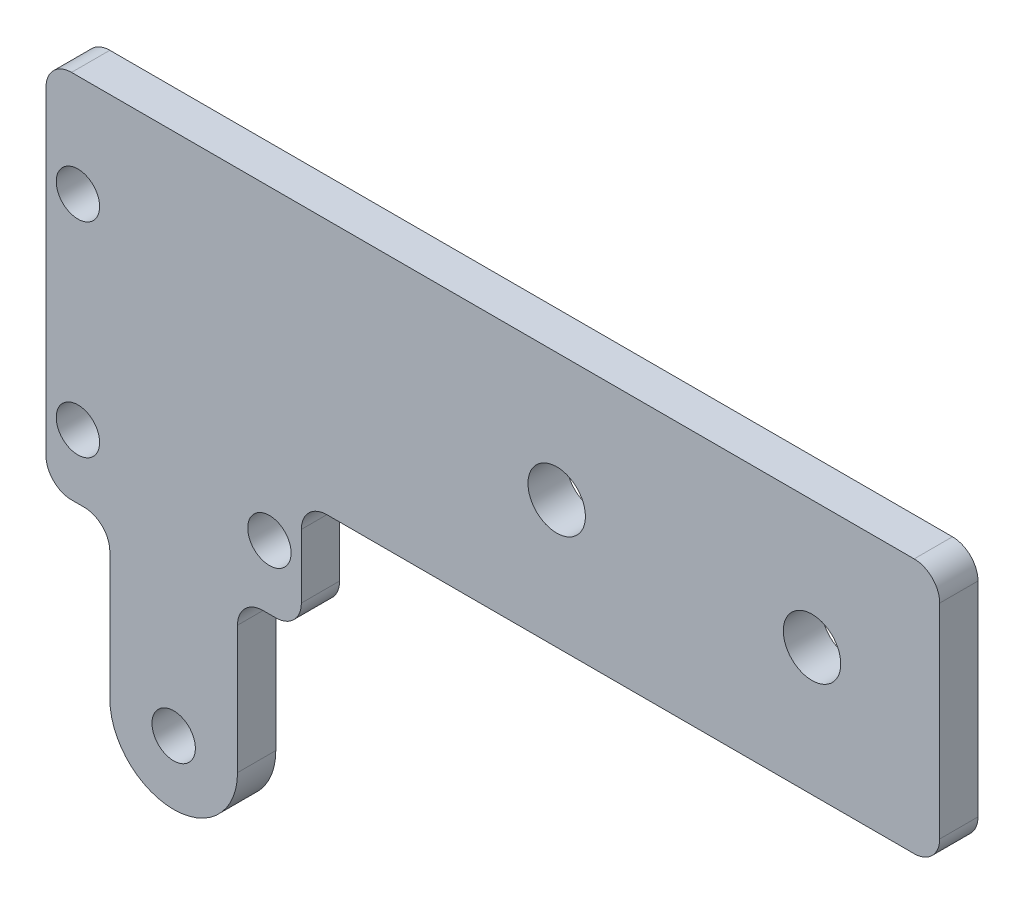
ISO-10303-21;
HEADER;
FILE_DESCRIPTION(('STEP AP214'),'2;1');
FILE_NAME('part.step','',(''),(''),'','','');
FILE_SCHEMA(('AUTOMOTIVE_DESIGN { 1 0 10303 214 1 1 1 1 }'));
ENDSEC;
DATA;
#1=APPLICATION_CONTEXT('core data for automotive mechanical design processes');
#2=APPLICATION_PROTOCOL_DEFINITION('international standard','automotive_design',2000,#1);
#3=PRODUCT_CONTEXT('',#1,'mechanical');
#4=PRODUCT('Part','Part','',(#3));
#5=PRODUCT_RELATED_PRODUCT_CATEGORY('part','',(#4));
#6=PRODUCT_DEFINITION_FORMATION('','',#4);
#7=PRODUCT_DEFINITION_CONTEXT('part definition',#1,'design');
#8=PRODUCT_DEFINITION('design','',#6,#7);
#9=PRODUCT_DEFINITION_SHAPE('','',#8);
#10=(LENGTH_UNIT() NAMED_UNIT(*) SI_UNIT(.MILLI.,.METRE.));
#11=(NAMED_UNIT(*) PLANE_ANGLE_UNIT() SI_UNIT($,.RADIAN.));
#12=(NAMED_UNIT(*) SI_UNIT($,.STERADIAN.) SOLID_ANGLE_UNIT());
#13=UNCERTAINTY_MEASURE_WITH_UNIT(LENGTH_MEASURE(1.E-05),#10,'distance_accuracy_value','');
#14=(GEOMETRIC_REPRESENTATION_CONTEXT(3) GLOBAL_UNCERTAINTY_ASSIGNED_CONTEXT((#13)) GLOBAL_UNIT_ASSIGNED_CONTEXT((#10,
#11,#12)) REPRESENTATION_CONTEXT('',''));
#15=CARTESIAN_POINT('',(0.,0.,0.));
#16=DIRECTION('',(0.,0.,1.));
#17=DIRECTION('',(1.,0.,0.));
#18=AXIS2_PLACEMENT_3D('',#15,#16,#17);
#19=CARTESIAN_POINT('',(50.,0.,3.));
#20=DIRECTION('',(0.,1.,0.));
#21=DIRECTION('',(-1.,0.,0.));
#22=AXIS2_PLACEMENT_3D('',#19,#20,#21);
#23=PLANE('',#22);
#24=DIRECTION('',(1.,0.,0.));
#25=VECTOR('',#24,1.);
#26=CARTESIAN_POINT('',(50.,0.,3.));
#27=LINE('',#26,#25);
#28=CARTESIAN_POINT('',(2.,0.,3.));
#29=VERTEX_POINT('',#28);
#30=CARTESIAN_POINT('',(48.,0.,3.));
#31=VERTEX_POINT('',#30);
#32=EDGE_CURVE('E223',#29,#31,#27,.T.);
#33=ORIENTED_EDGE('',*,*,#32,.F.);
#34=DIRECTION('',(0.,0.,-1.));
#35=VECTOR('',#34,1.);
#36=CARTESIAN_POINT('',(2.,0.,0.));
#37=LINE('',#36,#35);
#38=CARTESIAN_POINT('',(2.,0.,0.));
#39=VERTEX_POINT('',#38);
#40=EDGE_CURVE('E268',#29,#39,#37,.T.);
#41=ORIENTED_EDGE('',*,*,#40,.T.);
#42=DIRECTION('',(1.,0.,0.));
#43=VECTOR('',#42,1.);
#44=CARTESIAN_POINT('',(50.,0.,0.));
#45=LINE('',#44,#43);
#46=CARTESIAN_POINT('',(48.,0.,0.));
#47=VERTEX_POINT('',#46);
#48=EDGE_CURVE('E196',#39,#47,#45,.T.);
#49=ORIENTED_EDGE('',*,*,#48,.T.);
#50=DIRECTION('',(0.,0.,-1.));
#51=VECTOR('',#50,1.);
#52=CARTESIAN_POINT('',(48.,0.,3.));
#53=LINE('',#52,#51);
#54=EDGE_CURVE('E266',#47,#31,#53,.F.);
#55=ORIENTED_EDGE('',*,*,#54,.T.);
#56=EDGE_LOOP('',(#33,#41,#49,#55));
#57=FACE_BOUND('',#56,.T.);
#58=ADVANCED_FACE('F34',(#57),#23,.F.);
#59=CARTESIAN_POINT('',(50.,20.,3.));
#60=DIRECTION('',(-1.,0.,0.));
#61=DIRECTION('',(0.,0.,1.));
#62=AXIS2_PLACEMENT_3D('',#59,#60,#61);
#63=PLANE('',#62);
#64=DIRECTION('',(0.,1.,0.));
#65=VECTOR('',#64,1.);
#66=CARTESIAN_POINT('',(50.,20.,3.));
#67=LINE('',#66,#65);
#68=CARTESIAN_POINT('',(50.,2.,3.));
#69=VERTEX_POINT('',#68);
#70=CARTESIAN_POINT('',(50.,18.,3.));
#71=VERTEX_POINT('',#70);
#72=EDGE_CURVE('E303',#69,#71,#67,.T.);
#73=ORIENTED_EDGE('',*,*,#72,.F.);
#74=DIRECTION('',(0.,0.,-1.));
#75=VECTOR('',#74,1.);
#76=CARTESIAN_POINT('',(50.,2.,3.));
#77=LINE('',#76,#75);
#78=CARTESIAN_POINT('',(50.,2.,0.));
#79=VERTEX_POINT('',#78);
#80=EDGE_CURVE('E273',#69,#79,#77,.T.);
#81=ORIENTED_EDGE('',*,*,#80,.T.);
#82=DIRECTION('',(0.,1.,0.));
#83=VECTOR('',#82,1.);
#84=CARTESIAN_POINT('',(50.,20.,0.));
#85=LINE('',#84,#83);
#86=CARTESIAN_POINT('',(50.,18.,0.));
#87=VERTEX_POINT('',#86);
#88=EDGE_CURVE('E199',#79,#87,#85,.T.);
#89=ORIENTED_EDGE('',*,*,#88,.T.);
#90=DIRECTION('',(0.,0.,-1.));
#91=VECTOR('',#90,1.);
#92=CARTESIAN_POINT('',(50.,18.,3.));
#93=LINE('',#92,#91);
#94=EDGE_CURVE('E271',#87,#71,#93,.F.);
#95=ORIENTED_EDGE('',*,*,#94,.T.);
#96=EDGE_LOOP('',(#73,#81,#89,#95));
#97=FACE_BOUND('',#96,.T.);
#98=ADVANCED_FACE('F347',(#97),#63,.F.);
#99=CARTESIAN_POINT('',(-20.,20.,3.));
#100=DIRECTION('',(0.,-1.,0.));
#101=DIRECTION('',(0.,0.,-1.));
#102=AXIS2_PLACEMENT_3D('',#99,#100,#101);
#103=PLANE('',#102);
#104=DIRECTION('',(-1.,0.,0.));
#105=VECTOR('',#104,1.);
#106=CARTESIAN_POINT('',(-20.,20.,0.));
#107=LINE('',#106,#105);
#108=CARTESIAN_POINT('',(48.,20.,0.));
#109=VERTEX_POINT('',#108);
#110=CARTESIAN_POINT('',(-18.,20.,0.));
#111=VERTEX_POINT('',#110);
#112=EDGE_CURVE('E203',#109,#111,#107,.T.);
#113=ORIENTED_EDGE('',*,*,#112,.T.);
#114=DIRECTION('',(0.,0.,-1.));
#115=VECTOR('',#114,1.);
#116=CARTESIAN_POINT('',(-18.,20.,3.));
#117=LINE('',#116,#115);
#118=CARTESIAN_POINT('',(-18.,20.,3.));
#119=VERTEX_POINT('',#118);
#120=EDGE_CURVE('E279',#111,#119,#117,.F.);
#121=ORIENTED_EDGE('',*,*,#120,.T.);
#122=DIRECTION('',(-1.,0.,0.));
#123=VECTOR('',#122,1.);
#124=CARTESIAN_POINT('',(-20.,20.,3.));
#125=LINE('',#124,#123);
#126=CARTESIAN_POINT('',(48.,20.,3.));
#127=VERTEX_POINT('',#126);
#128=EDGE_CURVE('E306',#127,#119,#125,.T.);
#129=ORIENTED_EDGE('',*,*,#128,.F.);
#130=DIRECTION('',(0.,0.,-1.));
#131=VECTOR('',#130,1.);
#132=CARTESIAN_POINT('',(48.,20.,3.));
#133=LINE('',#132,#131);
#134=EDGE_CURVE('E276',#127,#109,#133,.T.);
#135=ORIENTED_EDGE('',*,*,#134,.T.);
#136=EDGE_LOOP('',(#113,#121,#129,#135));
#137=FACE_BOUND('',#136,.T.);
#138=ADVANCED_FACE('F352',(#137),#103,.F.);
#139=CARTESIAN_POINT('',(-20.,-9.,3.));
#140=DIRECTION('',(1.,0.,0.));
#141=DIRECTION('',(0.,0.,-1.));
#142=AXIS2_PLACEMENT_3D('',#139,#140,#141);
#143=PLANE('',#142);
#144=DIRECTION('',(0.,-1.,0.));
#145=VECTOR('',#144,1.);
#146=CARTESIAN_POINT('',(-20.,-9.,0.));
#147=LINE('',#146,#145);
#148=CARTESIAN_POINT('',(-20.,18.,0.));
#149=VERTEX_POINT('',#148);
#150=CARTESIAN_POINT('',(-20.,-7.,0.));
#151=VERTEX_POINT('',#150);
#152=EDGE_CURVE('E206',#149,#151,#147,.T.);
#153=ORIENTED_EDGE('',*,*,#152,.T.);
#154=DIRECTION('',(0.,0.,-1.));
#155=VECTOR('',#154,1.);
#156=CARTESIAN_POINT('',(-20.,-7.,3.));
#157=LINE('',#156,#155);
#158=CARTESIAN_POINT('',(-20.,-7.,3.));
#159=VERTEX_POINT('',#158);
#160=EDGE_CURVE('E242',#151,#159,#157,.F.);
#161=ORIENTED_EDGE('',*,*,#160,.T.);
#162=DIRECTION('',(0.,-1.,0.));
#163=VECTOR('',#162,1.);
#164=CARTESIAN_POINT('',(-20.,-9.,3.));
#165=LINE('',#164,#163);
#166=CARTESIAN_POINT('',(-20.,18.,3.));
#167=VERTEX_POINT('',#166);
#168=EDGE_CURVE('E314',#167,#159,#165,.T.);
#169=ORIENTED_EDGE('',*,*,#168,.F.);
#170=DIRECTION('',(0.,0.,-1.));
#171=VECTOR('',#170,1.);
#172=CARTESIAN_POINT('',(-20.,18.,3.));
#173=LINE('',#172,#171);
#174=EDGE_CURVE('E239',#167,#149,#173,.T.);
#175=ORIENTED_EDGE('',*,*,#174,.T.);
#176=EDGE_LOOP('',(#153,#161,#169,#175));
#177=FACE_BOUND('',#176,.T.);
#178=ADVANCED_FACE('F424',(#177),#143,.F.);
#179=CARTESIAN_POINT('',(-15.,-9.,3.));
#180=DIRECTION('',(0.,1.,0.));
#181=DIRECTION('',(-1.,0.,0.));
#182=AXIS2_PLACEMENT_3D('',#179,#180,#181);
#183=PLANE('',#182);
#184=DIRECTION('',(1.,0.,0.));
#185=VECTOR('',#184,1.);
#186=CARTESIAN_POINT('',(-15.,-9.,3.));
#187=LINE('',#186,#185);
#188=CARTESIAN_POINT('',(-18.,-9.,3.));
#189=VERTEX_POINT('',#188);
#190=CARTESIAN_POINT('',(-17.,-9.,3.));
#191=VERTEX_POINT('',#190);
#192=EDGE_CURVE('E172',#189,#191,#187,.T.);
#193=ORIENTED_EDGE('',*,*,#192,.F.);
#194=DIRECTION('',(0.,0.,-1.));
#195=VECTOR('',#194,1.);
#196=CARTESIAN_POINT('',(-18.,-9.,3.));
#197=LINE('',#196,#195);
#198=CARTESIAN_POINT('',(-18.,-9.,0.));
#199=VERTEX_POINT('',#198);
#200=EDGE_CURVE('E226',#189,#199,#197,.T.);
#201=ORIENTED_EDGE('',*,*,#200,.T.);
#202=DIRECTION('',(1.,0.,0.));
#203=VECTOR('',#202,1.);
#204=CARTESIAN_POINT('',(-15.,-9.,0.));
#205=LINE('',#204,#203);
#206=CARTESIAN_POINT('',(-17.,-9.,0.));
#207=VERTEX_POINT('',#206);
#208=EDGE_CURVE('E209',#199,#207,#205,.T.);
#209=ORIENTED_EDGE('',*,*,#208,.T.);
#210=DIRECTION('',(0.,0.,-1.));
#211=VECTOR('',#210,1.);
#212=CARTESIAN_POINT('',(-17.,-9.,3.));
#213=LINE('',#212,#211);
#214=EDGE_CURVE('E181',#207,#191,#213,.F.);
#215=ORIENTED_EDGE('',*,*,#214,.T.);
#216=EDGE_LOOP('',(#193,#201,#209,#215));
#217=FACE_BOUND('',#216,.T.);
#218=ADVANCED_FACE('F427',(#217),#183,.F.);
#219=CARTESIAN_POINT('',(-15.,-21.,3.));
#220=DIRECTION('',(1.,0.,0.));
#221=DIRECTION('',(0.,1.,0.));
#222=AXIS2_PLACEMENT_3D('',#219,#220,#221);
#223=PLANE('',#222);
#224=DIRECTION('',(0.,-1.,0.));
#225=VECTOR('',#224,1.);
#226=CARTESIAN_POINT('',(-15.,-21.,3.));
#227=LINE('',#226,#225);
#228=CARTESIAN_POINT('',(-15.,-11.,3.));
#229=VERTEX_POINT('',#228);
#230=CARTESIAN_POINT('',(-15.,-21.,3.));
#231=VERTEX_POINT('',#230);
#232=EDGE_CURVE('E158',#229,#231,#227,.T.);
#233=ORIENTED_EDGE('',*,*,#232,.F.);
#234=DIRECTION('',(0.,0.,-1.));
#235=VECTOR('',#234,1.);
#236=CARTESIAN_POINT('',(-15.,-11.,0.));
#237=LINE('',#236,#235);
#238=CARTESIAN_POINT('',(-15.,-11.,0.));
#239=VERTEX_POINT('',#238);
#240=EDGE_CURVE('E253',#229,#239,#237,.T.);
#241=ORIENTED_EDGE('',*,*,#240,.T.);
#242=DIRECTION('',(0.,-1.,0.));
#243=VECTOR('',#242,1.);
#244=CARTESIAN_POINT('',(-15.,-21.,0.));
#245=LINE('',#244,#243);
#246=CARTESIAN_POINT('',(-15.,-21.,0.));
#247=VERTEX_POINT('',#246);
#248=EDGE_CURVE('E178',#239,#247,#245,.T.);
#249=ORIENTED_EDGE('',*,*,#248,.T.);
#250=DIRECTION('',(0.,0.,-1.));
#251=VECTOR('',#250,1.);
#252=CARTESIAN_POINT('',(-15.,-21.,3.));
#253=LINE('',#252,#251);
#254=EDGE_CURVE('E175',#231,#247,#253,.T.);
#255=ORIENTED_EDGE('',*,*,#254,.F.);
#256=EDGE_LOOP('',(#233,#241,#249,#255));
#257=FACE_BOUND('',#256,.T.);
#258=ADVANCED_FACE('F176',(#257),#223,.F.);
#259=CARTESIAN_POINT('',(-10.,-21.,3.));
#260=DIRECTION('',(0.,0.,-1.));
#261=DIRECTION('',(-1.,0.,0.));
#262=AXIS2_PLACEMENT_3D('',#259,#260,#261);
#263=CYLINDRICAL_SURFACE('',#262,5.);
#264=CARTESIAN_POINT('',(-10.,-21.,0.));
#265=DIRECTION('',(0.,0.,1.));
#266=DIRECTION('',(1.,0.,0.));
#267=AXIS2_PLACEMENT_3D('',#264,#265,#266);
#268=CIRCLE('',#267,5.);
#269=CARTESIAN_POINT('',(-5.,-21.,0.));
#270=VERTEX_POINT('',#269);
#271=EDGE_CURVE('E213',#247,#270,#268,.T.);
#272=ORIENTED_EDGE('',*,*,#271,.T.);
#273=DIRECTION('',(0.,0.,-1.));
#274=VECTOR('',#273,1.);
#275=CARTESIAN_POINT('',(-5.,-21.,3.));
#276=LINE('',#275,#274);
#277=CARTESIAN_POINT('',(-5.,-21.,3.));
#278=VERTEX_POINT('',#277);
#279=EDGE_CURVE('E182',#278,#270,#276,.T.);
#280=ORIENTED_EDGE('',*,*,#279,.F.);
#281=CARTESIAN_POINT('',(-10.,-21.,3.));
#282=DIRECTION('',(0.,0.,1.));
#283=DIRECTION('',(1.,0.,0.));
#284=AXIS2_PLACEMENT_3D('',#281,#282,#283);
#285=CIRCLE('',#284,5.);
#286=EDGE_CURVE('E164',#231,#278,#285,.T.);
#287=ORIENTED_EDGE('',*,*,#286,.F.);
#288=ORIENTED_EDGE('',*,*,#254,.T.);
#289=EDGE_LOOP('',(#272,#280,#287,#288));
#290=FACE_BOUND('',#289,.T.);
#291=ADVANCED_FACE('F184',(#290),#263,.T.);
#292=CARTESIAN_POINT('',(-5.,-9.,3.));
#293=DIRECTION('',(-1.,0.,0.));
#294=DIRECTION('',(0.,0.,1.));
#295=AXIS2_PLACEMENT_3D('',#292,#293,#294);
#296=PLANE('',#295);
#297=DIRECTION('',(0.,1.,0.));
#298=VECTOR('',#297,1.);
#299=CARTESIAN_POINT('',(-5.,-9.,0.));
#300=LINE('',#299,#298);
#301=CARTESIAN_POINT('',(-5.,-11.,0.));
#302=VERTEX_POINT('',#301);
#303=EDGE_CURVE('E215',#270,#302,#300,.T.);
#304=ORIENTED_EDGE('',*,*,#303,.T.);
#305=DIRECTION('',(0.,0.,-1.));
#306=VECTOR('',#305,1.);
#307=CARTESIAN_POINT('',(-5.,-11.,3.));
#308=LINE('',#307,#306);
#309=CARTESIAN_POINT('',(-5.,-11.,3.));
#310=VERTEX_POINT('',#309);
#311=EDGE_CURVE('E260',#302,#310,#308,.F.);
#312=ORIENTED_EDGE('',*,*,#311,.T.);
#313=DIRECTION('',(0.,1.,0.));
#314=VECTOR('',#313,1.);
#315=CARTESIAN_POINT('',(-5.,-9.,3.));
#316=LINE('',#315,#314);
#317=EDGE_CURVE('E187',#278,#310,#316,.T.);
#318=ORIENTED_EDGE('',*,*,#317,.F.);
#319=ORIENTED_EDGE('',*,*,#279,.T.);
#320=EDGE_LOOP('',(#304,#312,#318,#319));
#321=FACE_BOUND('',#320,.T.);
#322=ADVANCED_FACE('F324',(#321),#296,.F.);
#323=CARTESIAN_POINT('',(0.,-9.,3.));
#324=DIRECTION('',(0.,1.,0.));
#325=DIRECTION('',(0.,0.,1.));
#326=AXIS2_PLACEMENT_3D('',#323,#324,#325);
#327=PLANE('',#326);
#328=DIRECTION('',(1.,0.,0.));
#329=VECTOR('',#328,1.);
#330=CARTESIAN_POINT('',(0.,-9.,3.));
#331=LINE('',#330,#329);
#332=CARTESIAN_POINT('',(-3.,-9.,3.));
#333=VERTEX_POINT('',#332);
#334=CARTESIAN_POINT('',(-2.,-9.,3.));
#335=VERTEX_POINT('',#334);
#336=EDGE_CURVE('E189',#333,#335,#331,.T.);
#337=ORIENTED_EDGE('',*,*,#336,.F.);
#338=DIRECTION('',(0.,0.,-1.));
#339=VECTOR('',#338,1.);
#340=CARTESIAN_POINT('',(-3.,-9.,0.));
#341=LINE('',#340,#339);
#342=CARTESIAN_POINT('',(-3.,-9.,0.));
#343=VERTEX_POINT('',#342);
#344=EDGE_CURVE('E257',#333,#343,#341,.T.);
#345=ORIENTED_EDGE('',*,*,#344,.T.);
#346=DIRECTION('',(1.,0.,0.));
#347=VECTOR('',#346,1.);
#348=CARTESIAN_POINT('',(0.,-9.,0.));
#349=LINE('',#348,#347);
#350=CARTESIAN_POINT('',(-2.,-9.,0.));
#351=VERTEX_POINT('',#350);
#352=EDGE_CURVE('E218',#343,#351,#349,.T.);
#353=ORIENTED_EDGE('',*,*,#352,.T.);
#354=DIRECTION('',(0.,0.,-1.));
#355=VECTOR('',#354,1.);
#356=CARTESIAN_POINT('',(-2.,-9.,3.));
#357=LINE('',#356,#355);
#358=EDGE_CURVE('E255',#351,#335,#357,.F.);
#359=ORIENTED_EDGE('',*,*,#358,.T.);
#360=EDGE_LOOP('',(#337,#345,#353,#359));
#361=FACE_BOUND('',#360,.T.);
#362=ADVANCED_FACE('F333',(#361),#327,.F.);
#363=CARTESIAN_POINT('',(0.,0.,3.));
#364=DIRECTION('',(-1.,0.,0.));
#365=DIRECTION('',(0.,-1.,0.));
#366=AXIS2_PLACEMENT_3D('',#363,#364,#365);
#367=PLANE('',#366);
#368=DIRECTION('',(0.,1.,0.));
#369=VECTOR('',#368,1.);
#370=CARTESIAN_POINT('',(0.,0.,3.));
#371=LINE('',#370,#369);
#372=CARTESIAN_POINT('',(0.,-7.,3.));
#373=VERTEX_POINT('',#372);
#374=CARTESIAN_POINT('',(0.,-2.,3.));
#375=VERTEX_POINT('',#374);
#376=EDGE_CURVE('E194',#373,#375,#371,.T.);
#377=ORIENTED_EDGE('',*,*,#376,.F.);
#378=DIRECTION('',(0.,0.,-1.));
#379=VECTOR('',#378,1.);
#380=CARTESIAN_POINT('',(0.,-7.,3.));
#381=LINE('',#380,#379);
#382=CARTESIAN_POINT('',(0.,-7.,0.));
#383=VERTEX_POINT('',#382);
#384=EDGE_CURVE('E263',#373,#383,#381,.T.);
#385=ORIENTED_EDGE('',*,*,#384,.T.);
#386=DIRECTION('',(0.,1.,0.));
#387=VECTOR('',#386,1.);
#388=CARTESIAN_POINT('',(0.,0.,0.));
#389=LINE('',#388,#387);
#390=CARTESIAN_POINT('',(0.,-2.,0.));
#391=VERTEX_POINT('',#390);
#392=EDGE_CURVE('E221',#383,#391,#389,.T.);
#393=ORIENTED_EDGE('',*,*,#392,.T.);
#394=DIRECTION('',(0.,0.,-1.));
#395=VECTOR('',#394,1.);
#396=CARTESIAN_POINT('',(0.,-2.,3.));
#397=LINE('',#396,#395);
#398=EDGE_CURVE('E49',#391,#375,#397,.F.);
#399=ORIENTED_EDGE('',*,*,#398,.T.);
#400=EDGE_LOOP('',(#377,#385,#393,#399));
#401=FACE_BOUND('',#400,.T.);
#402=ADVANCED_FACE('F294',(#401),#367,.F.);
#403=CARTESIAN_POINT('',(-10.,-21.,3.));
#404=DIRECTION('',(0.,0.,1.));
#405=DIRECTION('',(1.,0.,0.));
#406=AXIS2_PLACEMENT_3D('',#403,#404,#405);
#407=PLANE('',#406);
#408=CARTESIAN_POINT('',(-17.5,12.,3.));
#409=DIRECTION('',(0.,0.,1.));
#410=DIRECTION('',(1.,0.,0.));
#411=AXIS2_PLACEMENT_3D('',#408,#409,#410);
#412=CIRCLE('',#411,1.7);
#413=CARTESIAN_POINT('',(-15.8,12.,3.));
#414=VERTEX_POINT('',#413);
#415=EDGE_CURVE('E611',#414,#414,#412,.T.);
#416=ORIENTED_EDGE('',*,*,#415,.F.);
#417=EDGE_LOOP('',(#416));
#418=FACE_BOUND('',#417,.T.);
#419=CARTESIAN_POINT('',(-2.5,-4.,3.));
#420=DIRECTION('',(0.,0.,1.));
#421=DIRECTION('',(1.,0.,0.));
#422=AXIS2_PLACEMENT_3D('',#419,#420,#421);
#423=CIRCLE('',#422,1.7);
#424=CARTESIAN_POINT('',(-0.800000000000001,-4.,3.));
#425=VERTEX_POINT('',#424);
#426=EDGE_CURVE('E605',#425,#425,#423,.T.);
#427=ORIENTED_EDGE('',*,*,#426,.F.);
#428=EDGE_LOOP('',(#427));
#429=FACE_BOUND('',#428,.T.);
#430=CARTESIAN_POINT('',(-17.5,-4.,3.));
#431=DIRECTION('',(0.,0.,1.));
#432=DIRECTION('',(1.,0.,0.));
#433=AXIS2_PLACEMENT_3D('',#430,#431,#432);
#434=CIRCLE('',#433,1.7);
#435=CARTESIAN_POINT('',(-15.8,-4.,3.));
#436=VERTEX_POINT('',#435);
#437=EDGE_CURVE('E599',#436,#436,#434,.T.);
#438=ORIENTED_EDGE('',*,*,#437,.F.);
#439=EDGE_LOOP('',(#438));
#440=FACE_BOUND('',#439,.T.);
#441=CARTESIAN_POINT('',(40.,10.,3.));
#442=DIRECTION('',(0.,0.,1.));
#443=DIRECTION('',(1.,0.,0.));
#444=AXIS2_PLACEMENT_3D('',#441,#442,#443);
#445=CIRCLE('',#444,2.25);
#446=CARTESIAN_POINT('',(42.25,10.,3.));
#447=VERTEX_POINT('',#446);
#448=EDGE_CURVE('E593',#447,#447,#445,.T.);
#449=ORIENTED_EDGE('',*,*,#448,.F.);
#450=EDGE_LOOP('',(#449));
#451=FACE_BOUND('',#450,.T.);
#452=CARTESIAN_POINT('',(20.,10.,3.));
#453=DIRECTION('',(0.,0.,1.));
#454=DIRECTION('',(1.,0.,0.));
#455=AXIS2_PLACEMENT_3D('',#452,#453,#454);
#456=CIRCLE('',#455,2.25);
#457=CARTESIAN_POINT('',(22.25,10.,3.));
#458=VERTEX_POINT('',#457);
#459=EDGE_CURVE('E583',#458,#458,#456,.T.);
#460=ORIENTED_EDGE('',*,*,#459,.F.);
#461=EDGE_LOOP('',(#460));
#462=FACE_BOUND('',#461,.T.);
#463=CARTESIAN_POINT('',(-10.,-21.,3.));
#464=DIRECTION('',(0.,0.,1.));
#465=DIRECTION('',(1.,0.,0.));
#466=AXIS2_PLACEMENT_3D('',#463,#464,#465);
#467=CIRCLE('',#466,1.7);
#468=CARTESIAN_POINT('',(-8.3,-21.,3.));
#469=VERTEX_POINT('',#468);
#470=EDGE_CURVE('E309',#469,#469,#467,.T.);
#471=ORIENTED_EDGE('',*,*,#470,.F.);
#472=EDGE_LOOP('',(#471));
#473=FACE_BOUND('',#472,.T.);
#474=ORIENTED_EDGE('',*,*,#168,.T.);
#475=CARTESIAN_POINT('',(-18.,-7.,3.));
#476=DIRECTION('',(0.,0.,1.));
#477=DIRECTION('',(1.,0.,0.));
#478=AXIS2_PLACEMENT_3D('',#475,#476,#477);
#479=CIRCLE('',#478,2.);
#480=EDGE_CURVE('E251',#159,#189,#479,.T.);
#481=ORIENTED_EDGE('',*,*,#480,.T.);
#482=ORIENTED_EDGE('',*,*,#192,.T.);
#483=CARTESIAN_POINT('',(-17.,-11.,3.));
#484=DIRECTION('',(0.,0.,1.));
#485=DIRECTION('',(1.,0.,0.));
#486=AXIS2_PLACEMENT_3D('',#483,#484,#485);
#487=CIRCLE('',#486,2.);
#488=EDGE_CURVE('E168',#191,#229,#487,.F.);
#489=ORIENTED_EDGE('',*,*,#488,.T.);
#490=ORIENTED_EDGE('',*,*,#232,.T.);
#491=ORIENTED_EDGE('',*,*,#286,.T.);
#492=ORIENTED_EDGE('',*,*,#317,.T.);
#493=CARTESIAN_POINT('',(-3.,-11.,3.));
#494=DIRECTION('',(0.,0.,1.));
#495=DIRECTION('',(1.,0.,0.));
#496=AXIS2_PLACEMENT_3D('',#493,#494,#495);
#497=CIRCLE('',#496,2.);
#498=EDGE_CURVE('E286',#310,#333,#497,.F.);
#499=ORIENTED_EDGE('',*,*,#498,.T.);
#500=ORIENTED_EDGE('',*,*,#336,.T.);
#501=CARTESIAN_POINT('',(-2.,-7.,3.));
#502=DIRECTION('',(0.,0.,1.));
#503=DIRECTION('',(1.,0.,0.));
#504=AXIS2_PLACEMENT_3D('',#501,#502,#503);
#505=CIRCLE('',#504,2.);
#506=EDGE_CURVE('E56',#335,#373,#505,.T.);
#507=ORIENTED_EDGE('',*,*,#506,.T.);
#508=ORIENTED_EDGE('',*,*,#376,.T.);
#509=CARTESIAN_POINT('',(2.,-2.,3.));
#510=DIRECTION('',(0.,0.,1.));
#511=DIRECTION('',(1.,0.,0.));
#512=AXIS2_PLACEMENT_3D('',#509,#510,#511);
#513=CIRCLE('',#512,2.);
#514=EDGE_CURVE('E11',#375,#29,#513,.F.);
#515=ORIENTED_EDGE('',*,*,#514,.T.);
#516=ORIENTED_EDGE('',*,*,#32,.T.);
#517=CARTESIAN_POINT('',(48.,2.,3.));
#518=DIRECTION('',(0.,0.,1.));
#519=DIRECTION('',(1.,0.,0.));
#520=AXIS2_PLACEMENT_3D('',#517,#518,#519);
#521=CIRCLE('',#520,2.);
#522=EDGE_CURVE('E248',#31,#69,#521,.T.);
#523=ORIENTED_EDGE('',*,*,#522,.T.);
#524=ORIENTED_EDGE('',*,*,#72,.T.);
#525=CARTESIAN_POINT('',(48.,18.,3.));
#526=DIRECTION('',(0.,0.,1.));
#527=DIRECTION('',(1.,0.,0.));
#528=AXIS2_PLACEMENT_3D('',#525,#526,#527);
#529=CIRCLE('',#528,2.);
#530=EDGE_CURVE('E244',#71,#127,#529,.T.);
#531=ORIENTED_EDGE('',*,*,#530,.T.);
#532=ORIENTED_EDGE('',*,*,#128,.T.);
#533=CARTESIAN_POINT('',(-18.,18.,3.));
#534=DIRECTION('',(0.,0.,1.));
#535=DIRECTION('',(1.,0.,0.));
#536=AXIS2_PLACEMENT_3D('',#533,#534,#535);
#537=CIRCLE('',#536,2.);
#538=EDGE_CURVE('E246',#119,#167,#537,.T.);
#539=ORIENTED_EDGE('',*,*,#538,.T.);
#540=EDGE_LOOP('',(#474,#481,#482,#489,#490,#491,#492,#499,#500,#507,#508,#515,#516,#523,#524,
#531,#532,#539));
#541=FACE_BOUND('',#540,.T.);
#542=ADVANCED_FACE('F161',(#418,#429,#440,#451,#462,#473,#541),#407,.T.);
#543=CARTESIAN_POINT('',(-10.,-21.,0.));
#544=DIRECTION('',(0.,0.,1.));
#545=DIRECTION('',(1.,0.,0.));
#546=AXIS2_PLACEMENT_3D('',#543,#544,#545);
#547=PLANE('',#546);
#548=CARTESIAN_POINT('',(-17.5,12.,0.));
#549=DIRECTION('',(0.,0.,1.));
#550=DIRECTION('',(1.,0.,0.));
#551=AXIS2_PLACEMENT_3D('',#548,#549,#550);
#552=CIRCLE('',#551,1.7);
#553=CARTESIAN_POINT('',(-15.8,12.,0.));
#554=VERTEX_POINT('',#553);
#555=EDGE_CURVE('E608',#554,#554,#552,.T.);
#556=ORIENTED_EDGE('',*,*,#555,.T.);
#557=EDGE_LOOP('',(#556));
#558=FACE_BOUND('',#557,.T.);
#559=CARTESIAN_POINT('',(-2.5,-4.,0.));
#560=DIRECTION('',(0.,0.,1.));
#561=DIRECTION('',(1.,0.,0.));
#562=AXIS2_PLACEMENT_3D('',#559,#560,#561);
#563=CIRCLE('',#562,1.7);
#564=CARTESIAN_POINT('',(-0.800000000000002,-4.,0.));
#565=VERTEX_POINT('',#564);
#566=EDGE_CURVE('E602',#565,#565,#563,.T.);
#567=ORIENTED_EDGE('',*,*,#566,.T.);
#568=EDGE_LOOP('',(#567));
#569=FACE_BOUND('',#568,.T.);
#570=CARTESIAN_POINT('',(-17.5,-4.,0.));
#571=DIRECTION('',(0.,0.,1.));
#572=DIRECTION('',(1.,0.,0.));
#573=AXIS2_PLACEMENT_3D('',#570,#571,#572);
#574=CIRCLE('',#573,1.7);
#575=CARTESIAN_POINT('',(-15.8,-4.,0.));
#576=VERTEX_POINT('',#575);
#577=EDGE_CURVE('E596',#576,#576,#574,.T.);
#578=ORIENTED_EDGE('',*,*,#577,.T.);
#579=EDGE_LOOP('',(#578));
#580=FACE_BOUND('',#579,.T.);
#581=CARTESIAN_POINT('',(40.,10.,0.));
#582=DIRECTION('',(0.,0.,1.));
#583=DIRECTION('',(1.,0.,0.));
#584=AXIS2_PLACEMENT_3D('',#581,#582,#583);
#585=CIRCLE('',#584,2.25);
#586=CARTESIAN_POINT('',(42.25,10.,0.));
#587=VERTEX_POINT('',#586);
#588=EDGE_CURVE('E588',#587,#587,#585,.T.);
#589=ORIENTED_EDGE('',*,*,#588,.T.);
#590=EDGE_LOOP('',(#589));
#591=FACE_BOUND('',#590,.T.);
#592=CARTESIAN_POINT('',(20.,10.,0.));
#593=DIRECTION('',(0.,0.,1.));
#594=DIRECTION('',(1.,0.,0.));
#595=AXIS2_PLACEMENT_3D('',#592,#593,#594);
#596=CIRCLE('',#595,2.25);
#597=CARTESIAN_POINT('',(22.25,10.,0.));
#598=VERTEX_POINT('',#597);
#599=EDGE_CURVE('E581',#598,#598,#596,.T.);
#600=ORIENTED_EDGE('',*,*,#599,.T.);
#601=EDGE_LOOP('',(#600));
#602=FACE_BOUND('',#601,.T.);
#603=CARTESIAN_POINT('',(-10.,-21.,0.));
#604=DIRECTION('',(0.,0.,1.));
#605=DIRECTION('',(1.,0.,0.));
#606=AXIS2_PLACEMENT_3D('',#603,#604,#605);
#607=CIRCLE('',#606,1.7);
#608=CARTESIAN_POINT('',(-8.3,-21.,0.));
#609=VERTEX_POINT('',#608);
#610=EDGE_CURVE('E200',#609,#609,#607,.T.);
#611=ORIENTED_EDGE('',*,*,#610,.T.);
#612=EDGE_LOOP('',(#611));
#613=FACE_BOUND('',#612,.T.);
#614=ORIENTED_EDGE('',*,*,#208,.F.);
#615=CARTESIAN_POINT('',(-18.,-7.,0.));
#616=DIRECTION('',(0.,0.,1.));
#617=DIRECTION('',(1.,0.,0.));
#618=AXIS2_PLACEMENT_3D('',#615,#616,#617);
#619=CIRCLE('',#618,2.);
#620=EDGE_CURVE('E237',#199,#151,#619,.F.);
#621=ORIENTED_EDGE('',*,*,#620,.T.);
#622=ORIENTED_EDGE('',*,*,#152,.F.);
#623=CARTESIAN_POINT('',(-18.,18.,0.));
#624=DIRECTION('',(0.,0.,1.));
#625=DIRECTION('',(1.,0.,0.));
#626=AXIS2_PLACEMENT_3D('',#623,#624,#625);
#627=CIRCLE('',#626,2.);
#628=EDGE_CURVE('E231',#149,#111,#627,.F.);
#629=ORIENTED_EDGE('',*,*,#628,.T.);
#630=ORIENTED_EDGE('',*,*,#112,.F.);
#631=CARTESIAN_POINT('',(48.,18.,0.));
#632=DIRECTION('',(0.,0.,1.));
#633=DIRECTION('',(1.,0.,0.));
#634=AXIS2_PLACEMENT_3D('',#631,#632,#633);
#635=CIRCLE('',#634,2.);
#636=EDGE_CURVE('E229',#109,#87,#635,.F.);
#637=ORIENTED_EDGE('',*,*,#636,.T.);
#638=ORIENTED_EDGE('',*,*,#88,.F.);
#639=CARTESIAN_POINT('',(48.,2.,0.));
#640=DIRECTION('',(0.,0.,1.));
#641=DIRECTION('',(1.,0.,0.));
#642=AXIS2_PLACEMENT_3D('',#639,#640,#641);
#643=CIRCLE('',#642,2.);
#644=EDGE_CURVE('E233',#79,#47,#643,.F.);
#645=ORIENTED_EDGE('',*,*,#644,.T.);
#646=ORIENTED_EDGE('',*,*,#48,.F.);
#647=CARTESIAN_POINT('',(2.,-2.,0.));
#648=DIRECTION('',(0.,0.,1.));
#649=DIRECTION('',(1.,0.,0.));
#650=AXIS2_PLACEMENT_3D('',#647,#648,#649);
#651=CIRCLE('',#650,2.);
#652=EDGE_CURVE('E42',#39,#391,#651,.T.);
#653=ORIENTED_EDGE('',*,*,#652,.T.);
#654=ORIENTED_EDGE('',*,*,#392,.F.);
#655=CARTESIAN_POINT('',(-2.,-7.,0.));
#656=DIRECTION('',(0.,0.,1.));
#657=DIRECTION('',(1.,0.,0.));
#658=AXIS2_PLACEMENT_3D('',#655,#656,#657);
#659=CIRCLE('',#658,2.);
#660=EDGE_CURVE('E235',#383,#351,#659,.F.);
#661=ORIENTED_EDGE('',*,*,#660,.T.);
#662=ORIENTED_EDGE('',*,*,#352,.F.);
#663=CARTESIAN_POINT('',(-3.,-11.,0.));
#664=DIRECTION('',(0.,0.,1.));
#665=DIRECTION('',(1.,0.,0.));
#666=AXIS2_PLACEMENT_3D('',#663,#664,#665);
#667=CIRCLE('',#666,2.);
#668=EDGE_CURVE('E284',#343,#302,#667,.T.);
#669=ORIENTED_EDGE('',*,*,#668,.T.);
#670=ORIENTED_EDGE('',*,*,#303,.F.);
#671=ORIENTED_EDGE('',*,*,#271,.F.);
#672=ORIENTED_EDGE('',*,*,#248,.F.);
#673=CARTESIAN_POINT('',(-17.,-11.,0.));
#674=DIRECTION('',(0.,0.,1.));
#675=DIRECTION('',(1.,0.,0.));
#676=AXIS2_PLACEMENT_3D('',#673,#674,#675);
#677=CIRCLE('',#676,2.);
#678=EDGE_CURVE('E281',#239,#207,#677,.T.);
#679=ORIENTED_EDGE('',*,*,#678,.T.);
#680=EDGE_LOOP('',(#614,#621,#622,#629,#630,#637,#638,#645,#646,#653,#654,#661,#662,#669,#670,
#671,#672,#679));
#681=FACE_BOUND('',#680,.T.);
#682=ADVANCED_FACE('F291',(#558,#569,#580,#591,#602,#613,#681),#547,.F.);
#683=CARTESIAN_POINT('',(-10.,-21.,0.));
#684=DIRECTION('',(0.,0.,1.));
#685=DIRECTION('',(1.,0.,0.));
#686=AXIS2_PLACEMENT_3D('',#683,#684,#685);
#687=CYLINDRICAL_SURFACE('',#686,1.7);
#688=ORIENTED_EDGE('',*,*,#610,.F.);
#689=EDGE_LOOP('',(#688));
#690=FACE_BOUND('',#689,.T.);
#691=ORIENTED_EDGE('',*,*,#470,.T.);
#692=EDGE_LOOP('',(#691));
#693=FACE_BOUND('',#692,.T.);
#694=ADVANCED_FACE('F501',(#690,#693),#687,.F.);
#695=CARTESIAN_POINT('',(20.,10.,3.));
#696=DIRECTION('',(0.,0.,1.));
#697=DIRECTION('',(1.,0.,0.));
#698=AXIS2_PLACEMENT_3D('',#695,#696,#697);
#699=CYLINDRICAL_SURFACE('',#698,2.25);
#700=ORIENTED_EDGE('',*,*,#599,.F.);
#701=EDGE_LOOP('',(#700));
#702=FACE_BOUND('',#701,.T.);
#703=ORIENTED_EDGE('',*,*,#459,.T.);
#704=EDGE_LOOP('',(#703));
#705=FACE_BOUND('',#704,.T.);
#706=ADVANCED_FACE('F547',(#702,#705),#699,.F.);
#707=CARTESIAN_POINT('',(40.,10.,3.));
#708=DIRECTION('',(0.,0.,1.));
#709=DIRECTION('',(1.,0.,0.));
#710=AXIS2_PLACEMENT_3D('',#707,#708,#709);
#711=CYLINDRICAL_SURFACE('',#710,2.25);
#712=ORIENTED_EDGE('',*,*,#588,.F.);
#713=EDGE_LOOP('',(#712));
#714=FACE_BOUND('',#713,.T.);
#715=ORIENTED_EDGE('',*,*,#448,.T.);
#716=EDGE_LOOP('',(#715));
#717=FACE_BOUND('',#716,.T.);
#718=ADVANCED_FACE('F538',(#714,#717),#711,.F.);
#719=CARTESIAN_POINT('',(-17.5,-4.,3.));
#720=DIRECTION('',(0.,0.,1.));
#721=DIRECTION('',(1.,0.,0.));
#722=AXIS2_PLACEMENT_3D('',#719,#720,#721);
#723=CYLINDRICAL_SURFACE('',#722,1.7);
#724=ORIENTED_EDGE('',*,*,#577,.F.);
#725=EDGE_LOOP('',(#724));
#726=FACE_BOUND('',#725,.T.);
#727=ORIENTED_EDGE('',*,*,#437,.T.);
#728=EDGE_LOOP('',(#727));
#729=FACE_BOUND('',#728,.T.);
#730=ADVANCED_FACE('F529',(#726,#729),#723,.F.);
#731=CARTESIAN_POINT('',(-2.5,-4.,3.));
#732=DIRECTION('',(0.,0.,1.));
#733=DIRECTION('',(1.,0.,0.));
#734=AXIS2_PLACEMENT_3D('',#731,#732,#733);
#735=CYLINDRICAL_SURFACE('',#734,1.7);
#736=ORIENTED_EDGE('',*,*,#566,.F.);
#737=EDGE_LOOP('',(#736));
#738=FACE_BOUND('',#737,.T.);
#739=ORIENTED_EDGE('',*,*,#426,.T.);
#740=EDGE_LOOP('',(#739));
#741=FACE_BOUND('',#740,.T.);
#742=ADVANCED_FACE('F520',(#738,#741),#735,.F.);
#743=CARTESIAN_POINT('',(-17.5,12.,3.));
#744=DIRECTION('',(0.,0.,1.));
#745=DIRECTION('',(1.,0.,0.));
#746=AXIS2_PLACEMENT_3D('',#743,#744,#745);
#747=CYLINDRICAL_SURFACE('',#746,1.7);
#748=ORIENTED_EDGE('',*,*,#555,.F.);
#749=EDGE_LOOP('',(#748));
#750=FACE_BOUND('',#749,.T.);
#751=ORIENTED_EDGE('',*,*,#415,.T.);
#752=EDGE_LOOP('',(#751));
#753=FACE_BOUND('',#752,.T.);
#754=ADVANCED_FACE('F360',(#750,#753),#747,.F.);
#755=CARTESIAN_POINT('',(-18.,-7.,3.));
#756=DIRECTION('',(0.,0.,-1.));
#757=DIRECTION('',(-1.,0.,0.));
#758=AXIS2_PLACEMENT_3D('',#755,#756,#757);
#759=CYLINDRICAL_SURFACE('',#758,2.);
#760=ORIENTED_EDGE('',*,*,#480,.F.);
#761=ORIENTED_EDGE('',*,*,#160,.F.);
#762=ORIENTED_EDGE('',*,*,#620,.F.);
#763=ORIENTED_EDGE('',*,*,#200,.F.);
#764=EDGE_LOOP('',(#760,#761,#762,#763));
#765=FACE_BOUND('',#764,.T.);
#766=ADVANCED_FACE('F357',(#765),#759,.T.);
#767=CARTESIAN_POINT('',(-17.,-11.,3.));
#768=DIRECTION('',(0.,0.,1.));
#769=DIRECTION('',(1.,0.,0.));
#770=AXIS2_PLACEMENT_3D('',#767,#768,#769);
#771=CYLINDRICAL_SURFACE('',#770,2.);
#772=ORIENTED_EDGE('',*,*,#488,.F.);
#773=ORIENTED_EDGE('',*,*,#214,.F.);
#774=ORIENTED_EDGE('',*,*,#678,.F.);
#775=ORIENTED_EDGE('',*,*,#240,.F.);
#776=EDGE_LOOP('',(#772,#773,#774,#775));
#777=FACE_BOUND('',#776,.T.);
#778=ADVANCED_FACE('F321',(#777),#771,.F.);
#779=CARTESIAN_POINT('',(-3.,-11.,3.));
#780=DIRECTION('',(0.,0.,1.));
#781=DIRECTION('',(1.,0.,0.));
#782=AXIS2_PLACEMENT_3D('',#779,#780,#781);
#783=CYLINDRICAL_SURFACE('',#782,2.);
#784=ORIENTED_EDGE('',*,*,#498,.F.);
#785=ORIENTED_EDGE('',*,*,#311,.F.);
#786=ORIENTED_EDGE('',*,*,#668,.F.);
#787=ORIENTED_EDGE('',*,*,#344,.F.);
#788=EDGE_LOOP('',(#784,#785,#786,#787));
#789=FACE_BOUND('',#788,.T.);
#790=ADVANCED_FACE('F330',(#789),#783,.F.);
#791=CARTESIAN_POINT('',(-2.,-7.,3.));
#792=DIRECTION('',(0.,0.,-1.));
#793=DIRECTION('',(-1.,0.,0.));
#794=AXIS2_PLACEMENT_3D('',#791,#792,#793);
#795=CYLINDRICAL_SURFACE('',#794,2.);
#796=ORIENTED_EDGE('',*,*,#506,.F.);
#797=ORIENTED_EDGE('',*,*,#358,.F.);
#798=ORIENTED_EDGE('',*,*,#660,.F.);
#799=ORIENTED_EDGE('',*,*,#384,.F.);
#800=EDGE_LOOP('',(#796,#797,#798,#799));
#801=FACE_BOUND('',#800,.T.);
#802=ADVANCED_FACE('F336',(#801),#795,.T.);
#803=CARTESIAN_POINT('',(2.,-2.,3.));
#804=DIRECTION('',(0.,0.,1.));
#805=DIRECTION('',(1.,0.,0.));
#806=AXIS2_PLACEMENT_3D('',#803,#804,#805);
#807=CYLINDRICAL_SURFACE('',#806,2.);
#808=ORIENTED_EDGE('',*,*,#514,.F.);
#809=ORIENTED_EDGE('',*,*,#398,.F.);
#810=ORIENTED_EDGE('',*,*,#652,.F.);
#811=ORIENTED_EDGE('',*,*,#40,.F.);
#812=EDGE_LOOP('',(#808,#809,#810,#811));
#813=FACE_BOUND('',#812,.T.);
#814=ADVANCED_FACE('F297',(#813),#807,.F.);
#815=CARTESIAN_POINT('',(48.,2.,3.));
#816=DIRECTION('',(0.,0.,-1.));
#817=DIRECTION('',(-1.,0.,0.));
#818=AXIS2_PLACEMENT_3D('',#815,#816,#817);
#819=CYLINDRICAL_SURFACE('',#818,2.);
#820=ORIENTED_EDGE('',*,*,#522,.F.);
#821=ORIENTED_EDGE('',*,*,#54,.F.);
#822=ORIENTED_EDGE('',*,*,#644,.F.);
#823=ORIENTED_EDGE('',*,*,#80,.F.);
#824=EDGE_LOOP('',(#820,#821,#822,#823));
#825=FACE_BOUND('',#824,.T.);
#826=ADVANCED_FACE('F343',(#825),#819,.T.);
#827=CARTESIAN_POINT('',(-18.,18.,3.));
#828=DIRECTION('',(0.,0.,-1.));
#829=DIRECTION('',(-1.,0.,0.));
#830=AXIS2_PLACEMENT_3D('',#827,#828,#829);
#831=CYLINDRICAL_SURFACE('',#830,2.);
#832=ORIENTED_EDGE('',*,*,#538,.F.);
#833=ORIENTED_EDGE('',*,*,#120,.F.);
#834=ORIENTED_EDGE('',*,*,#628,.F.);
#835=ORIENTED_EDGE('',*,*,#174,.F.);
#836=EDGE_LOOP('',(#832,#833,#834,#835));
#837=FACE_BOUND('',#836,.T.);
#838=ADVANCED_FACE('F391',(#837),#831,.T.);
#839=CARTESIAN_POINT('',(48.,18.,3.));
#840=DIRECTION('',(0.,0.,-1.));
#841=DIRECTION('',(-1.,0.,0.));
#842=AXIS2_PLACEMENT_3D('',#839,#840,#841);
#843=CYLINDRICAL_SURFACE('',#842,2.);
#844=ORIENTED_EDGE('',*,*,#530,.F.);
#845=ORIENTED_EDGE('',*,*,#94,.F.);
#846=ORIENTED_EDGE('',*,*,#636,.F.);
#847=ORIENTED_EDGE('',*,*,#134,.F.);
#848=EDGE_LOOP('',(#844,#845,#846,#847));
#849=FACE_BOUND('',#848,.T.);
#850=ADVANCED_FACE('F36',(#849),#843,.T.);
#851=CLOSED_SHELL('',(#58,#98,#138,#178,#218,#258,#291,#322,#362,#402,#542,#682,#694,#706,#718,
#730,#742,#754,#766,#778,#790,#802,#814,#826,#838,#850));
#852=MANIFOLD_SOLID_BREP('B2',#851);
#853=ADVANCED_BREP_SHAPE_REPRESENTATION('',(#18,#852),#14);
#854=SHAPE_DEFINITION_REPRESENTATION(#9,#853);
ENDSEC;
END-ISO-10303-21;
